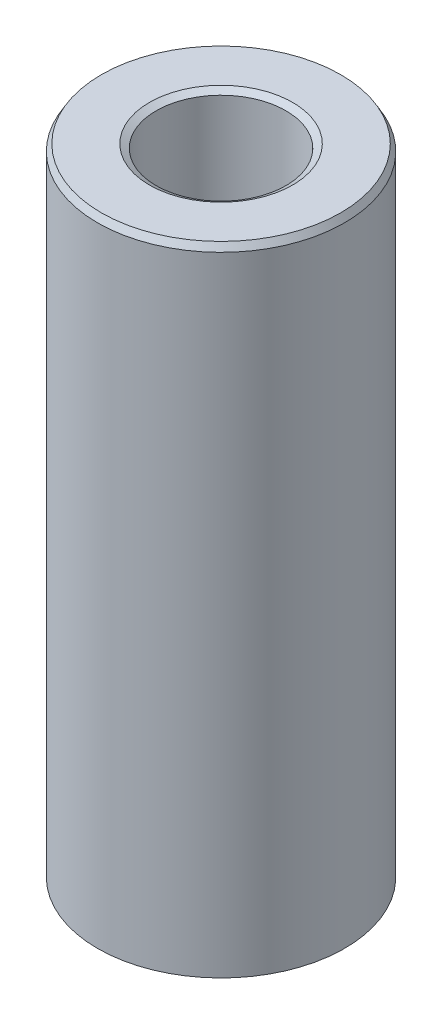
ISO-10303-21;
HEADER;
FILE_DESCRIPTION(('STEP AP214'),'2;1');
FILE_NAME('part.step','',(''),(''),'','','');
FILE_SCHEMA(('AUTOMOTIVE_DESIGN { 1 0 10303 214 1 1 1 1 }'));
ENDSEC;
DATA;
#1=APPLICATION_CONTEXT('core data for automotive mechanical design processes');
#2=APPLICATION_PROTOCOL_DEFINITION('international standard','automotive_design',2000,#1);
#3=PRODUCT_CONTEXT('',#1,'mechanical');
#4=PRODUCT('Part','Part','',(#3));
#5=PRODUCT_RELATED_PRODUCT_CATEGORY('part','',(#4));
#6=PRODUCT_DEFINITION_FORMATION('','',#4);
#7=PRODUCT_DEFINITION_CONTEXT('part definition',#1,'design');
#8=PRODUCT_DEFINITION('design','',#6,#7);
#9=PRODUCT_DEFINITION_SHAPE('','',#8);
#10=(LENGTH_UNIT() NAMED_UNIT(*) SI_UNIT(.MILLI.,.METRE.));
#11=(NAMED_UNIT(*) PLANE_ANGLE_UNIT() SI_UNIT($,.RADIAN.));
#12=(NAMED_UNIT(*) SI_UNIT($,.STERADIAN.) SOLID_ANGLE_UNIT());
#13=UNCERTAINTY_MEASURE_WITH_UNIT(LENGTH_MEASURE(1.E-05),#10,'distance_accuracy_value','');
#14=(GEOMETRIC_REPRESENTATION_CONTEXT(3) GLOBAL_UNCERTAINTY_ASSIGNED_CONTEXT((#13)) GLOBAL_UNIT_ASSIGNED_CONTEXT((#10,
#11,#12)) REPRESENTATION_CONTEXT('',''));
#15=CARTESIAN_POINT('',(0.,0.,0.));
#16=DIRECTION('',(0.,0.,1.));
#17=DIRECTION('',(1.,0.,0.));
#18=AXIS2_PLACEMENT_3D('',#15,#16,#17);
#19=CARTESIAN_POINT('',(0.,271.512539755077,0.));
#20=DIRECTION('',(0.,-1.,0.));
#21=DIRECTION('',(0.,0.,-1.));
#22=AXIS2_PLACEMENT_3D('',#19,#20,#21);
#23=CYLINDRICAL_SURFACE('',#22,52.5);
#24=CARTESIAN_POINT('',(0.,1.64491623255325,0.));
#25=DIRECTION('',(0.,1.,0.));
#26=DIRECTION('',(0.,0.,1.));
#27=AXIS2_PLACEMENT_3D('',#24,#25,#26);
#28=CIRCLE('',#27,52.5);
#29=CARTESIAN_POINT('',(0.,1.64491623255325,52.5));
#30=VERTEX_POINT('',#29);
#31=EDGE_CURVE('E10',#30,#30,#28,.T.);
#32=ORIENTED_EDGE('',*,*,#31,.T.);
#33=EDGE_LOOP('',(#32));
#34=FACE_BOUND('',#33,.T.);
#35=CARTESIAN_POINT('',(0.,268.6634612661,0.));
#36=DIRECTION('',(0.,1.,0.));
#37=DIRECTION('',(0.,0.,1.));
#38=AXIS2_PLACEMENT_3D('',#35,#36,#37);
#39=CIRCLE('',#38,52.5);
#40=CARTESIAN_POINT('',(0.,268.6634612661,52.5));
#41=VERTEX_POINT('',#40);
#42=EDGE_CURVE('E50',#41,#41,#39,.F.);
#43=ORIENTED_EDGE('',*,*,#42,.T.);
#44=EDGE_LOOP('',(#43));
#45=FACE_BOUND('',#44,.T.);
#46=ADVANCED_FACE('F39',(#34,#45),#23,.T.);
#47=CARTESIAN_POINT('',(0.,271.512539755077,0.));
#48=DIRECTION('',(0.,1.,0.));
#49=DIRECTION('',(0.,0.,1.));
#50=AXIS2_PLACEMENT_3D('',#47,#48,#49);
#51=PLANE('',#50);
#52=CARTESIAN_POINT('',(0.,271.512539755077,0.));
#53=DIRECTION('',(0.,1.,0.));
#54=DIRECTION('',(0.,0.,1.));
#55=AXIS2_PLACEMENT_3D('',#52,#53,#54);
#56=CIRCLE('',#55,30.4304076067825);
#57=CARTESIAN_POINT('',(0.,271.512539755077,30.4304076067825));
#58=VERTEX_POINT('',#57);
#59=EDGE_CURVE('E58',#58,#58,#56,.F.);
#60=ORIENTED_EDGE('',*,*,#59,.T.);
#61=EDGE_LOOP('',(#60));
#62=FACE_BOUND('',#61,.T.);
#63=CARTESIAN_POINT('',(0.,271.512539755077,0.));
#64=DIRECTION('',(0.,1.,0.));
#65=DIRECTION('',(0.,0.,1.));
#66=AXIS2_PLACEMENT_3D('',#63,#64,#65);
#67=CIRCLE('',#66,50.8550837674468);
#68=CARTESIAN_POINT('',(0.,271.512539755077,50.8550837674468));
#69=VERTEX_POINT('',#68);
#70=EDGE_CURVE('E61',#69,#69,#67,.T.);
#71=ORIENTED_EDGE('',*,*,#70,.T.);
#72=EDGE_LOOP('',(#71));
#73=FACE_BOUND('',#72,.T.);
#74=ADVANCED_FACE('F88',(#62,#73),#51,.T.);
#75=CARTESIAN_POINT('',(0.,0.,0.));
#76=DIRECTION('',(0.,1.,0.));
#77=DIRECTION('',(0.,0.,1.));
#78=AXIS2_PLACEMENT_3D('',#75,#76,#77);
#79=PLANE('',#78);
#80=CARTESIAN_POINT('',(0.,0.,0.));
#81=DIRECTION('',(0.,1.,0.));
#82=DIRECTION('',(0.,0.,1.));
#83=AXIS2_PLACEMENT_3D('',#80,#81,#82);
#84=CIRCLE('',#83,29.2262453503588);
#85=CARTESIAN_POINT('',(0.,0.,29.2262453503588));
#86=VERTEX_POINT('',#85);
#87=EDGE_CURVE('E51',#86,#86,#84,.T.);
#88=ORIENTED_EDGE('',*,*,#87,.T.);
#89=EDGE_LOOP('',(#88));
#90=FACE_BOUND('',#89,.T.);
#91=CARTESIAN_POINT('',(0.,0.,0.));
#92=DIRECTION('',(0.,1.,0.));
#93=DIRECTION('',(0.,0.,1.));
#94=AXIS2_PLACEMENT_3D('',#91,#92,#93);
#95=CIRCLE('',#94,49.6509215110229);
#96=CARTESIAN_POINT('',(0.,0.,49.6509215110229));
#97=VERTEX_POINT('',#96);
#98=EDGE_CURVE('E54',#97,#97,#95,.F.);
#99=ORIENTED_EDGE('',*,*,#98,.T.);
#100=EDGE_LOOP('',(#99));
#101=FACE_BOUND('',#100,.T.);
#102=ADVANCED_FACE('F83',(#90,#101),#79,.F.);
#103=CARTESIAN_POINT('',(0.,271.512539755077,0.));
#104=DIRECTION('',(0.,-1.,0.));
#105=DIRECTION('',(0.,0.,-1.));
#106=AXIS2_PLACEMENT_3D('',#103,#104,#105);
#107=CYLINDRICAL_SURFACE('',#106,27.5813291178055);
#108=CARTESIAN_POINT('',(0.,269.867623522524,0.));
#109=DIRECTION('',(0.,1.,0.));
#110=DIRECTION('',(0.,0.,1.));
#111=AXIS2_PLACEMENT_3D('',#108,#109,#110);
#112=CIRCLE('',#111,27.5813291178055);
#113=CARTESIAN_POINT('',(0.,269.867623522524,27.5813291178055));
#114=VERTEX_POINT('',#113);
#115=EDGE_CURVE('E67',#114,#114,#112,.T.);
#116=ORIENTED_EDGE('',*,*,#115,.T.);
#117=EDGE_LOOP('',(#116));
#118=FACE_BOUND('',#117,.T.);
#119=CARTESIAN_POINT('',(0.,2.84907848897714,0.));
#120=DIRECTION('',(0.,1.,0.));
#121=DIRECTION('',(0.,0.,1.));
#122=AXIS2_PLACEMENT_3D('',#119,#120,#121);
#123=CIRCLE('',#122,27.5813291178055);
#124=CARTESIAN_POINT('',(0.,2.84907848897714,27.5813291178055));
#125=VERTEX_POINT('',#124);
#126=EDGE_CURVE('E69',#125,#125,#123,.F.);
#127=ORIENTED_EDGE('',*,*,#126,.T.);
#128=EDGE_LOOP('',(#127));
#129=FACE_BOUND('',#128,.T.);
#130=ADVANCED_FACE('F71',(#118,#129),#107,.F.);
#131=CARTESIAN_POINT('',(0.,269.867623522524,0.));
#132=DIRECTION('',(0.,1.,0.));
#133=DIRECTION('',(0.,0.,1.));
#134=AXIS2_PLACEMENT_3D('',#131,#132,#133);
#135=CONICAL_SURFACE('',#134,27.5813291178055,1.0471975511966);
#136=ORIENTED_EDGE('',*,*,#59,.F.);
#137=EDGE_LOOP('',(#136));
#138=FACE_BOUND('',#137,.T.);
#139=ORIENTED_EDGE('',*,*,#115,.F.);
#140=EDGE_LOOP('',(#139));
#141=FACE_BOUND('',#140,.T.);
#142=ADVANCED_FACE('F77',(#138,#141),#135,.F.);
#143=CARTESIAN_POINT('',(0.,0.,0.));
#144=DIRECTION('',(0.,-1.,0.));
#145=DIRECTION('',(0.,0.,-1.));
#146=AXIS2_PLACEMENT_3D('',#143,#144,#145);
#147=CONICAL_SURFACE('',#146,29.2262453503588,0.523598775598293);
#148=ORIENTED_EDGE('',*,*,#126,.F.);
#149=EDGE_LOOP('',(#148));
#150=FACE_BOUND('',#149,.T.);
#151=ORIENTED_EDGE('',*,*,#87,.F.);
#152=EDGE_LOOP('',(#151));
#153=FACE_BOUND('',#152,.T.);
#154=ADVANCED_FACE('F73',(#150,#153),#147,.F.);
#155=CARTESIAN_POINT('',(0.,1.64491623255325,0.));
#156=DIRECTION('',(0.,1.,0.));
#157=DIRECTION('',(0.,0.,1.));
#158=AXIS2_PLACEMENT_3D('',#155,#156,#157);
#159=CONICAL_SURFACE('',#158,52.5,1.04719755119661);
#160=ORIENTED_EDGE('',*,*,#98,.F.);
#161=EDGE_LOOP('',(#160));
#162=FACE_BOUND('',#161,.T.);
#163=ORIENTED_EDGE('',*,*,#31,.F.);
#164=EDGE_LOOP('',(#163));
#165=FACE_BOUND('',#164,.T.);
#166=ADVANCED_FACE('F76',(#162,#165),#159,.T.);
#167=CARTESIAN_POINT('',(0.,271.512539755077,0.));
#168=DIRECTION('',(0.,-1.,0.));
#169=DIRECTION('',(0.,0.,-1.));
#170=AXIS2_PLACEMENT_3D('',#167,#168,#169);
#171=CONICAL_SURFACE('',#170,50.8550837674468,0.523598775598299);
#172=ORIENTED_EDGE('',*,*,#42,.F.);
#173=EDGE_LOOP('',(#172));
#174=FACE_BOUND('',#173,.T.);
#175=ORIENTED_EDGE('',*,*,#70,.F.);
#176=EDGE_LOOP('',(#175));
#177=FACE_BOUND('',#176,.T.);
#178=ADVANCED_FACE('F45',(#174,#177),#171,.T.);
#179=CLOSED_SHELL('',(#46,#74,#102,#130,#142,#154,#166,#178));
#180=MANIFOLD_SOLID_BREP('B2',#179);
#181=ADVANCED_BREP_SHAPE_REPRESENTATION('',(#18,#180),#14);
#182=SHAPE_DEFINITION_REPRESENTATION(#9,#181);
ENDSEC;
END-ISO-10303-21;
